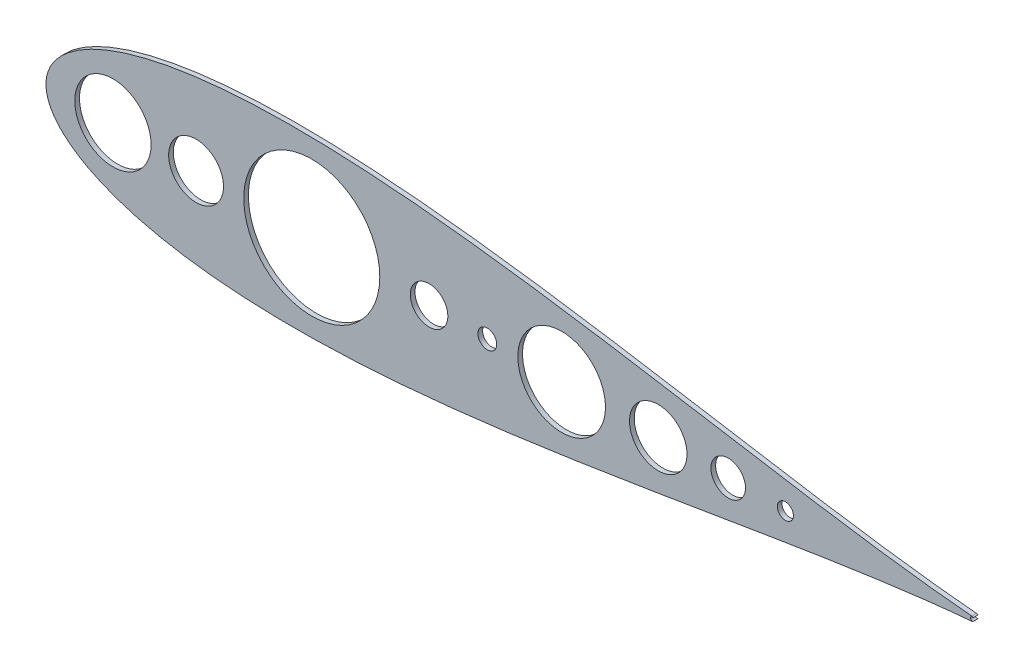
ISO-10303-21;
HEADER;
FILE_DESCRIPTION(('STEP AP214'),'2;1');
FILE_NAME('part.step','',(''),(''),'','','');
FILE_SCHEMA(('AUTOMOTIVE_DESIGN { 1 0 10303 214 1 1 1 1 }'));
ENDSEC;
DATA;
#1=APPLICATION_CONTEXT('core data for automotive mechanical design processes');
#2=APPLICATION_PROTOCOL_DEFINITION('international standard','automotive_design',2000,#1);
#3=PRODUCT_CONTEXT('',#1,'mechanical');
#4=PRODUCT('Part','Part','',(#3));
#5=PRODUCT_RELATED_PRODUCT_CATEGORY('part','',(#4));
#6=PRODUCT_DEFINITION_FORMATION('','',#4);
#7=PRODUCT_DEFINITION_CONTEXT('part definition',#1,'design');
#8=PRODUCT_DEFINITION('design','',#6,#7);
#9=PRODUCT_DEFINITION_SHAPE('','',#8);
#10=(LENGTH_UNIT() NAMED_UNIT(*) SI_UNIT(.MILLI.,.METRE.));
#11=(NAMED_UNIT(*) PLANE_ANGLE_UNIT() SI_UNIT($,.RADIAN.));
#12=(NAMED_UNIT(*) SI_UNIT($,.STERADIAN.) SOLID_ANGLE_UNIT());
#13=UNCERTAINTY_MEASURE_WITH_UNIT(LENGTH_MEASURE(1.E-05),#10,'distance_accuracy_value','');
#14=(GEOMETRIC_REPRESENTATION_CONTEXT(3) GLOBAL_UNCERTAINTY_ASSIGNED_CONTEXT((#13)) GLOBAL_UNIT_ASSIGNED_CONTEXT((#10,
#11,#12)) REPRESENTATION_CONTEXT('',''));
#15=CARTESIAN_POINT('',(0.,0.,0.));
#16=DIRECTION('',(0.,0.,1.));
#17=DIRECTION('',(1.,0.,0.));
#18=AXIS2_PLACEMENT_3D('',#15,#16,#17);
#19=CARTESIAN_POINT('',(750.96298118879,1063.57483485931,4.81012499999929));
#20=DIRECTION('',(0.,0.,1.));
#21=DIRECTION('',(1.,0.,0.));
#22=AXIS2_PLACEMENT_3D('',#19,#20,#21);
#23=PLANE('',#22);
#24=CARTESIAN_POINT('',(1225.90754513621,1063.57483486312,4.81012499999929));
#25=DIRECTION('',(0.,0.,1.));
#26=DIRECTION('',(1.,0.,0.));
#27=AXIS2_PLACEMENT_3D('',#24,#25,#26);
#28=CIRCLE('',#27,12.0363095643992);
#29=CARTESIAN_POINT('',(1237.94385470061,1063.57483486312,4.81012499999929));
#30=VERTEX_POINT('',#29);
#31=EDGE_CURVE('E163',#30,#30,#28,.T.);
#32=ORIENTED_EDGE('',*,*,#31,.F.);
#33=EDGE_LOOP('',(#32));
#34=FACE_BOUND('',#33,.T.);
#35=CARTESIAN_POINT('',(1265.69021931975,1063.57483486312,4.81012499999929));
#36=DIRECTION('',(0.,0.,1.));
#37=DIRECTION('',(1.,0.,0.));
#38=AXIS2_PLACEMENT_3D('',#35,#36,#37);
#39=CIRCLE('',#38,5.6061087540338);
#40=CARTESIAN_POINT('',(1271.29632807378,1063.57483486312,4.81012499999929));
#41=VERTEX_POINT('',#40);
#42=EDGE_CURVE('E151',#41,#41,#39,.T.);
#43=ORIENTED_EDGE('',*,*,#42,.F.);
#44=EDGE_LOOP('',(#43));
#45=FACE_BOUND('',#44,.T.);
#46=CARTESIAN_POINT('',(1109.95315939017,1063.57483486312,4.81012499999929));
#47=DIRECTION('',(0.,0.,1.));
#48=DIRECTION('',(1.,0.,0.));
#49=AXIS2_PLACEMENT_3D('',#46,#47,#48);
#50=CIRCLE('',#49,30.5054598019569);
#51=CARTESIAN_POINT('',(1140.45861919213,1063.57483486312,4.81012499999929));
#52=VERTEX_POINT('',#51);
#53=EDGE_CURVE('E139',#52,#52,#50,.T.);
#54=ORIENTED_EDGE('',*,*,#53,.F.);
#55=EDGE_LOOP('',(#54));
#56=FACE_BOUND('',#55,.T.);
#57=CARTESIAN_POINT('',(1017.6427119839,1063.57483486312,4.81012499999929));
#58=DIRECTION('',(0.,0.,1.));
#59=DIRECTION('',(1.,0.,0.));
#60=AXIS2_PLACEMENT_3D('',#57,#58,#59);
#61=CIRCLE('',#60,13.0809999999999);
#62=CARTESIAN_POINT('',(1030.7237119839,1063.57483486312,4.81012499999929));
#63=VERTEX_POINT('',#62);
#64=EDGE_CURVE('E127',#63,#63,#61,.T.);
#65=ORIENTED_EDGE('',*,*,#64,.F.);
#66=EDGE_LOOP('',(#65));
#67=FACE_BOUND('',#66,.T.);
#68=CARTESIAN_POINT('',(1395.54271540743,1065.1619681414,4.81012499999929));
#69=CARTESIAN_POINT('',(1395.02359226667,1065.2051382173,4.81012499999929));
#70=CARTESIAN_POINT('',(1391.11137142289,1065.53467168619,4.81012499999929));
#71=CARTESIAN_POINT('',(1383.40673114295,1066.24679645382,4.81012499999929));
#72=CARTESIAN_POINT('',(1371.97033086179,1067.43648312019,4.81012499999929));
#73=CARTESIAN_POINT('',(1359.29049716418,1068.89634410407,4.81012499999929));
#74=CARTESIAN_POINT('',(1345.41489513551,1070.63513095081,4.81012499999929));
#75=CARTESIAN_POINT('',(1330.40826044631,1072.65461405474,4.81012499999929));
#76=CARTESIAN_POINT('',(1314.33548887505,1074.95026580541,4.81012499999929));
#77=CARTESIAN_POINT('',(1297.2661813294,1077.51022817673,4.81012499999929));
#78=CARTESIAN_POINT('',(1279.27282238898,1080.3162900731,4.81012499999929));
#79=CARTESIAN_POINT('',(1260.43079370007,1083.34339698181,4.81012499999929));
#80=CARTESIAN_POINT('',(1240.81796180438,1086.56028304599,4.81012499999929));
#81=CARTESIAN_POINT('',(1220.51445178747,1089.92986172357,4.81012499999929));
#82=CARTESIAN_POINT('',(1199.60238766341,1093.40960189519,4.81012499999929));
#83=CARTESIAN_POINT('',(1178.1657547595,1096.95228942362,4.81012499999929));
#84=CARTESIAN_POINT('',(1156.29026158533,1100.50659397454,4.81012499999929));
#85=CARTESIAN_POINT('',(1134.06326757876,1104.01791043503,4.81012499999929));
#86=CARTESIAN_POINT('',(1111.57373575794,1107.42909486976,4.81012499999929));
#87=CARTESIAN_POINT('',(1088.912229171,1110.68147885688,4.81012499999929));
#88=CARTESIAN_POINT('',(1066.17090029136,1113.71561385179,4.81012499999929));
#89=CARTESIAN_POINT('',(1043.44351338479,1116.47233079811,4.81012499999929));
#90=CARTESIAN_POINT('',(1020.82546008262,1118.89359053819,4.81012499999929));
#91=CARTESIAN_POINT('',(998.41377395764,1120.92350871244,4.81012499999929));
#92=CARTESIAN_POINT('',(976.30712125808,1122.50917096927,4.81012499999929));
#93=CARTESIAN_POINT('',(954.605798988363,1123.60162243142,4.81012499999929));
#94=CARTESIAN_POINT('',(933.411713091856,1124.15678877121,4.81012499999929));
#95=CARTESIAN_POINT('',(912.828343784823,1124.13617779891,4.81012499999929));
#96=CARTESIAN_POINT('',(892.960780365688,1123.5070931482,4.81012499999929));
#97=CARTESIAN_POINT('',(873.915722858416,1122.24490422424,4.81012499999929));
#98=CARTESIAN_POINT('',(855.801792065221,1120.33130805021,4.81012499999929));
#99=CARTESIAN_POINT('',(838.729701584953,1117.75767882981,4.81012499999929));
#100=CARTESIAN_POINT('',(822.813292693368,1114.52311376375,4.81012499999929));
#101=CARTESIAN_POINT('',(808.170307258803,1110.63843631356,4.81012499999929));
#102=CARTESIAN_POINT('',(794.92453738176,1106.12641362733,4.81012499999929));
#103=CARTESIAN_POINT('',(783.208122525341,1101.02724858493,4.81012499999929));
#104=CARTESIAN_POINT('',(773.163344289858,1095.40846548432,4.81012499999929));
#105=CARTESIAN_POINT('',(764.94026711645,1089.38408601224,4.81012499999929));
#106=CARTESIAN_POINT('',(758.677358242983,1083.1508750198,4.81012499999929));
#107=CARTESIAN_POINT('',(754.437268830906,1077.0384028212,4.81012499999929));
#108=CARTESIAN_POINT('',(752.072876809349,1071.52373760801,4.81012499999929));
#109=CARTESIAN_POINT('',(751.118090619656,1067.09994589948,4.81012499999929));
#110=CARTESIAN_POINT('',(750.900629463039,1063.57483485931,4.81012499999929));
#111=CARTESIAN_POINT('',(751.118090619656,1060.04972381913,4.81012499999929));
#112=CARTESIAN_POINT('',(752.072876809349,1055.6259321106,4.81012499999929));
#113=CARTESIAN_POINT('',(754.437268830906,1050.11126689741,4.81012499999929));
#114=CARTESIAN_POINT('',(758.677358242983,1043.99879469882,4.81012499999929));
#115=CARTESIAN_POINT('',(764.94026711645,1037.76558370637,4.81012499999929));
#116=CARTESIAN_POINT('',(773.163344289858,1031.74120423429,4.81012499999929));
#117=CARTESIAN_POINT('',(783.208122525341,1026.12242113369,4.81012499999929));
#118=CARTESIAN_POINT('',(794.92453738176,1021.02325609128,4.81012499999929));
#119=CARTESIAN_POINT('',(808.170307258803,1016.51123340505,4.81012499999929));
#120=CARTESIAN_POINT('',(822.813292693368,1012.62655595486,4.81012499999929));
#121=CARTESIAN_POINT('',(838.729701584953,1009.3919908888,4.81012499999929));
#122=CARTESIAN_POINT('',(855.801792065221,1006.8183616684,4.81012499999929));
#123=CARTESIAN_POINT('',(873.915722858416,1004.90476549437,4.81012499999929));
#124=CARTESIAN_POINT('',(892.960780365688,1003.64257657042,4.81012499999929));
#125=CARTESIAN_POINT('',(912.828343784823,1003.01349191971,4.81012499999929));
#126=CARTESIAN_POINT('',(933.411713091856,1002.99288094741,4.81012499999929));
#127=CARTESIAN_POINT('',(954.605798988363,1003.54804728719,4.81012499999929));
#128=CARTESIAN_POINT('',(976.30712125808,1004.64049874934,4.81012499999929));
#129=CARTESIAN_POINT('',(998.41377395764,1006.22616100617,4.81012499999929));
#130=CARTESIAN_POINT('',(1020.82546008262,1008.25607918042,4.81012499999929));
#131=CARTESIAN_POINT('',(1043.44351338479,1010.67733892051,4.81012499999929));
#132=CARTESIAN_POINT('',(1066.17090029136,1013.43405586682,4.81012499999929));
#133=CARTESIAN_POINT('',(1088.912229171,1016.46819086173,4.81012499999929));
#134=CARTESIAN_POINT('',(1111.57373575794,1019.72057484885,4.81012499999929));
#135=CARTESIAN_POINT('',(1134.06326757876,1023.13175928358,4.81012499999929));
#136=CARTESIAN_POINT('',(1156.29026158533,1026.64307574407,4.81012499999929));
#137=CARTESIAN_POINT('',(1178.1657547595,1030.197380295,4.81012499999929));
#138=CARTESIAN_POINT('',(1199.60238766341,1033.74006782342,4.81012499999929));
#139=CARTESIAN_POINT('',(1220.51445178747,1037.21980799505,4.81012499999929));
#140=CARTESIAN_POINT('',(1240.81796180438,1040.58938667263,4.81012499999929));
#141=CARTESIAN_POINT('',(1260.43079370007,1043.80627273681,4.81012499999929));
#142=CARTESIAN_POINT('',(1279.27282238898,1046.83337964551,4.81012499999929));
#143=CARTESIAN_POINT('',(1297.2661813294,1049.63944154189,4.81012499999929));
#144=CARTESIAN_POINT('',(1314.33548887505,1052.1994039132,4.81012499999929));
#145=CARTESIAN_POINT('',(1330.40826044631,1054.49505566387,4.81012499999929));
#146=CARTESIAN_POINT('',(1345.41489513551,1056.51453876781,4.81012499999929));
#147=CARTESIAN_POINT('',(1359.29049716418,1058.25332561455,4.81012499999929));
#148=CARTESIAN_POINT('',(1371.97033086179,1059.71318659842,4.81012499999929));
#149=CARTESIAN_POINT('',(1383.40673114295,1060.9028732648,4.81012499999929));
#150=CARTESIAN_POINT('',(1391.1113714229,1061.61499803243,4.81012499999929));
#151=CARTESIAN_POINT('',(1395.02359226667,1061.94453150131,4.81012499999929));
#152=CARTESIAN_POINT('',(1395.54271540743,1061.98770158483,4.81012499999929));
#153=B_SPLINE_CURVE_WITH_KNOTS('',3,(#68,#69,#70,#71,#72,#73,#74,#75,#76,#77,#78,#79,#80,#81,
#82,#83,#84,#85,#86,#87,#88,#89,#90,#91,#92,#93,#94,#95,#96,#97,#98,#99,#100,#101,#102,#103,
#104,#105,#106,#107,#108,#109,#110,#111,#112,#113,#114,#115,#116,#117,#118,#119,#120,#121,#122,
#123,#124,#125,#126,#127,#128,#129,#130,#131,#132,#133,#134,#135,#136,#137,#138,#139,#140,#141,
#142,#143,#144,#145,#146,#147,#148,#149,#150,#151,#152),.UNSPECIFIED.,.F.,.F.,(4,1,1,1,1,1,1,1,
1,1,1,1,1,1,1,1,1,1,1,1,1,1,1,1,1,1,1,1,1,1,1,1,1,1,1,1,1,1,1,1,1,1,1,1,1,1,1,1,1,1,1,1,1,1,1,1,
1,1,1,1,1,1,1,1,1,1,1,1,1,1,1,1,1,1,1,1,1,1,1,1,1,1,4),(0.020157042076269,0.0212708876900959,
0.0285525550130683,0.0367806836725549,0.0459201019032637,0.0559317636633187,0.0667728836144854,
0.0783971303496518,0.0907548266908363,0.103793164577546,0.117456431914319,0.131686225652521,
0.146421738497113,0.161599998000845,0.177156132626574,0.193023668070302,0.209134785631037,
0.225420632511523,0.241811601924249,0.258237646860869,0.274628556698349,0.290914287398014,
0.307025228908797,0.322892517177238,0.33844834182358,0.353626206573582,0.368361231970712,
0.382590427827798,0.396252960572084,0.40929041186716,0.421647009590257,0.433269881487031,
0.444109248914041,0.454118639688981,0.463255054987312,0.471479113777303,0.478755288570903,
0.485052318112802,0.490344025694165,0.494609832614287,0.497833231437255,0.5,0.502166768562745,
0.505390167385713,0.509655974305835,0.514947681887198,0.521244711429097,0.528520886222697,
0.536744945012688,0.545881360311019,0.555890751085959,0.566730118512969,0.578352990409744,
0.59070958813284,0.603747039427916,0.617409572172202,0.631638768029288,0.646373793426418,
0.66155165817642,0.677107482822761,0.692974771091203,0.709085712601986,0.725371443301651,
0.741762353139131,0.758188398075751,0.774579367488477,0.790865214368963,0.806976331929698,
0.822843867373426,0.838400001999155,0.853578261502887,0.868313774347479,0.882543568085681,
0.896206835422454,0.909245173309164,0.921602869650348,0.933227116385514,0.944068236336681,
0.954079898096736,0.963219316327445,0.971447444986932,0.978729112309904,0.979842957923731),.UNSPECIFIED.);
#154=CARTESIAN_POINT('',(1395.54271540743,1065.1619681414,4.81012499999929));
#155=VERTEX_POINT('',#154);
#156=CARTESIAN_POINT('',(1395.54271540743,1061.98770158483,4.81012499999929));
#157=VERTEX_POINT('',#156);
#158=EDGE_CURVE('E87',#155,#157,#153,.T.);
#159=ORIENTED_EDGE('',*,*,#158,.T.);
#160=CARTESIAN_POINT('',(1395.4107300173,1063.57483486312,4.81012499999929));
#161=DIRECTION('',(0.,0.,1.));
#162=DIRECTION('',(1.,0.,0.));
#163=AXIS2_PLACEMENT_3D('',#160,#161,#162);
#164=CIRCLE('',#163,1.59261174999997);
#165=CARTESIAN_POINT('',(1396.53719164141,1062.44900343895,4.81012499999929));
#166=VERTEX_POINT('',#165);
#167=EDGE_CURVE('E82',#157,#166,#164,.T.);
#168=ORIENTED_EDGE('',*,*,#167,.T.);
#169=CARTESIAN_POINT('',(1395.91054943941,1063.57483486312,4.81012499999929));
#170=DIRECTION('',(0.,0.,-1.));
#171=DIRECTION('',(1.,0.,0.));
#172=AXIS2_PLACEMENT_3D('',#169,#170,#171);
#173=CIRCLE('',#172,1.28847849999987);
#174=CARTESIAN_POINT('',(1396.53719164141,1064.70066628728,4.81012499999929));
#175=VERTEX_POINT('',#174);
#176=EDGE_CURVE('E85',#166,#175,#173,.T.);
#177=ORIENTED_EDGE('',*,*,#176,.T.);
#178=CARTESIAN_POINT('',(1395.4107300173,1063.57483486312,4.81012499999929));
#179=DIRECTION('',(0.,0.,1.));
#180=DIRECTION('',(1.,0.,0.));
#181=AXIS2_PLACEMENT_3D('',#178,#179,#180);
#182=CIRCLE('',#181,1.59261174999997);
#183=EDGE_CURVE('E52',#175,#155,#182,.T.);
#184=ORIENTED_EDGE('',*,*,#183,.T.);
#185=EDGE_LOOP('',(#159,#168,#177,#184));
#186=FACE_BOUND('',#185,.T.);
#187=CARTESIAN_POINT('',(797.561846149155,1063.57483486312,4.81012499999929));
#188=DIRECTION('',(0.,0.,1.));
#189=DIRECTION('',(1.,0.,0.));
#190=AXIS2_PLACEMENT_3D('',#187,#188,#189);
#191=CIRCLE('',#190,26.5597967027053);
#192=CARTESIAN_POINT('',(824.12164285186,1063.57483486312,4.81012499999929));
#193=VERTEX_POINT('',#192);
#194=EDGE_CURVE('E103',#193,#193,#191,.T.);
#195=ORIENTED_EDGE('',*,*,#194,.F.);
#196=EDGE_LOOP('',(#195));
#197=FACE_BOUND('',#196,.T.);
#198=CARTESIAN_POINT('',(1177.19804743647,1063.57483486312,4.81012499999929));
#199=DIRECTION('',(0.,0.,1.));
#200=DIRECTION('',(1.,0.,0.));
#201=AXIS2_PLACEMENT_3D('',#198,#199,#200);
#202=CIRCLE('',#201,20.0025316274244);
#203=CARTESIAN_POINT('',(1197.2005790639,1063.57483486312,4.81012499999929));
#204=VERTEX_POINT('',#203);
#205=EDGE_CURVE('E133',#204,#204,#202,.T.);
#206=ORIENTED_EDGE('',*,*,#205,.F.);
#207=EDGE_LOOP('',(#206));
#208=FACE_BOUND('',#207,.T.);
#209=CARTESIAN_POINT('',(935.97297740518,1063.57483486312,4.81012499999929));
#210=DIRECTION('',(0.,0.,1.));
#211=DIRECTION('',(1.,0.,0.));
#212=AXIS2_PLACEMENT_3D('',#209,#210,#211);
#213=CIRCLE('',#212,47.3611230643591);
#214=CARTESIAN_POINT('',(983.334100469539,1063.57483486312,4.81012499999929));
#215=VERTEX_POINT('',#214);
#216=EDGE_CURVE('E145',#215,#215,#213,.T.);
#217=ORIENTED_EDGE('',*,*,#216,.F.);
#218=EDGE_LOOP('',(#217));
#219=FACE_BOUND('',#218,.T.);
#220=CARTESIAN_POINT('',(855.438311983901,1063.57483486312,4.81012499999929));
#221=DIRECTION('',(0.,0.,1.));
#222=DIRECTION('',(1.,0.,0.));
#223=AXIS2_PLACEMENT_3D('',#220,#221,#222);
#224=CIRCLE('',#223,19.0982600000001);
#225=CARTESIAN_POINT('',(874.536571983901,1063.57483486312,4.81012499999929));
#226=VERTEX_POINT('',#225);
#227=EDGE_CURVE('E157',#226,#226,#224,.T.);
#228=ORIENTED_EDGE('',*,*,#227,.F.);
#229=EDGE_LOOP('',(#228));
#230=FACE_BOUND('',#229,.T.);
#231=CARTESIAN_POINT('',(1058.1938119839,1063.57483486312,4.81012499999929));
#232=DIRECTION('',(0.,0.,1.));
#233=DIRECTION('',(1.,0.,0.));
#234=AXIS2_PLACEMENT_3D('',#231,#232,#233);
#235=CIRCLE('',#234,6.54050000000008);
#236=CARTESIAN_POINT('',(1064.7343119839,1063.57483486312,4.81012499999929));
#237=VERTEX_POINT('',#236);
#238=EDGE_CURVE('E169',#237,#237,#235,.T.);
#239=ORIENTED_EDGE('',*,*,#238,.F.);
#240=EDGE_LOOP('',(#239));
#241=FACE_BOUND('',#240,.T.);
#242=ADVANCED_FACE('F34',(#34,#45,#56,#67,#186,#197,#208,#219,#230,#241),#23,.T.);
#243=CARTESIAN_POINT('',(750.96298118879,1063.57483485931,1.53987499999929));
#244=DIRECTION('',(0.,0.,1.));
#245=DIRECTION('',(1.,0.,0.));
#246=AXIS2_PLACEMENT_3D('',#243,#244,#245);
#247=PLANE('',#246);
#248=CARTESIAN_POINT('',(1395.54271540743,1065.1619681414,1.53987499999929));
#249=CARTESIAN_POINT('',(1395.02359226667,1065.2051382173,1.53987499999929));
#250=CARTESIAN_POINT('',(1391.11137142289,1065.53467168619,1.53987499999929));
#251=CARTESIAN_POINT('',(1383.40673114295,1066.24679645382,1.53987499999929));
#252=CARTESIAN_POINT('',(1371.97033086179,1067.43648312019,1.53987499999929));
#253=CARTESIAN_POINT('',(1359.29049716418,1068.89634410407,1.53987499999929));
#254=CARTESIAN_POINT('',(1345.41489513551,1070.63513095081,1.53987499999929));
#255=CARTESIAN_POINT('',(1330.40826044631,1072.65461405474,1.53987499999929));
#256=CARTESIAN_POINT('',(1314.33548887505,1074.95026580541,1.53987499999929));
#257=CARTESIAN_POINT('',(1297.2661813294,1077.51022817673,1.53987499999929));
#258=CARTESIAN_POINT('',(1279.27282238898,1080.3162900731,1.53987499999929));
#259=CARTESIAN_POINT('',(1260.43079370007,1083.34339698181,1.53987499999929));
#260=CARTESIAN_POINT('',(1240.81796180438,1086.56028304599,1.53987499999929));
#261=CARTESIAN_POINT('',(1220.51445178747,1089.92986172357,1.53987499999929));
#262=CARTESIAN_POINT('',(1199.60238766341,1093.40960189519,1.53987499999929));
#263=CARTESIAN_POINT('',(1178.1657547595,1096.95228942362,1.53987499999929));
#264=CARTESIAN_POINT('',(1156.29026158533,1100.50659397454,1.53987499999929));
#265=CARTESIAN_POINT('',(1134.06326757876,1104.01791043503,1.53987499999929));
#266=CARTESIAN_POINT('',(1111.57373575794,1107.42909486976,1.53987499999929));
#267=CARTESIAN_POINT('',(1088.912229171,1110.68147885688,1.53987499999929));
#268=CARTESIAN_POINT('',(1066.17090029136,1113.71561385179,1.53987499999929));
#269=CARTESIAN_POINT('',(1043.44351338479,1116.47233079811,1.53987499999929));
#270=CARTESIAN_POINT('',(1020.82546008262,1118.89359053819,1.53987499999929));
#271=CARTESIAN_POINT('',(998.41377395764,1120.92350871244,1.53987499999929));
#272=CARTESIAN_POINT('',(976.30712125808,1122.50917096927,1.53987499999929));
#273=CARTESIAN_POINT('',(954.605798988363,1123.60162243142,1.53987499999929));
#274=CARTESIAN_POINT('',(933.411713091856,1124.15678877121,1.53987499999929));
#275=CARTESIAN_POINT('',(912.828343784823,1124.13617779891,1.53987499999929));
#276=CARTESIAN_POINT('',(892.960780365688,1123.5070931482,1.53987499999929));
#277=CARTESIAN_POINT('',(873.915722858416,1122.24490422424,1.53987499999929));
#278=CARTESIAN_POINT('',(855.801792065221,1120.33130805021,1.53987499999929));
#279=CARTESIAN_POINT('',(838.729701584953,1117.75767882981,1.53987499999929));
#280=CARTESIAN_POINT('',(822.813292693368,1114.52311376375,1.53987499999929));
#281=CARTESIAN_POINT('',(808.170307258803,1110.63843631356,1.53987499999929));
#282=CARTESIAN_POINT('',(794.92453738176,1106.12641362733,1.53987499999929));
#283=CARTESIAN_POINT('',(783.208122525341,1101.02724858493,1.53987499999929));
#284=CARTESIAN_POINT('',(773.163344289858,1095.40846548432,1.53987499999929));
#285=CARTESIAN_POINT('',(764.94026711645,1089.38408601224,1.53987499999929));
#286=CARTESIAN_POINT('',(758.677358242983,1083.1508750198,1.53987499999929));
#287=CARTESIAN_POINT('',(754.437268830906,1077.0384028212,1.53987499999929));
#288=CARTESIAN_POINT('',(752.072876809349,1071.52373760801,1.53987499999929));
#289=CARTESIAN_POINT('',(751.118090619656,1067.09994589948,1.53987499999929));
#290=CARTESIAN_POINT('',(750.900629463039,1063.57483485931,1.53987499999929));
#291=CARTESIAN_POINT('',(751.118090619656,1060.04972381913,1.53987499999929));
#292=CARTESIAN_POINT('',(752.072876809349,1055.6259321106,1.53987499999929));
#293=CARTESIAN_POINT('',(754.437268830906,1050.11126689741,1.53987499999929));
#294=CARTESIAN_POINT('',(758.677358242983,1043.99879469882,1.53987499999929));
#295=CARTESIAN_POINT('',(764.94026711645,1037.76558370637,1.53987499999929));
#296=CARTESIAN_POINT('',(773.163344289858,1031.74120423429,1.53987499999929));
#297=CARTESIAN_POINT('',(783.208122525341,1026.12242113369,1.53987499999929));
#298=CARTESIAN_POINT('',(794.92453738176,1021.02325609128,1.53987499999929));
#299=CARTESIAN_POINT('',(808.170307258803,1016.51123340505,1.53987499999929));
#300=CARTESIAN_POINT('',(822.813292693368,1012.62655595486,1.53987499999929));
#301=CARTESIAN_POINT('',(838.729701584953,1009.3919908888,1.53987499999929));
#302=CARTESIAN_POINT('',(855.801792065221,1006.8183616684,1.53987499999929));
#303=CARTESIAN_POINT('',(873.915722858416,1004.90476549437,1.53987499999929));
#304=CARTESIAN_POINT('',(892.960780365688,1003.64257657042,1.53987499999929));
#305=CARTESIAN_POINT('',(912.828343784823,1003.01349191971,1.53987499999929));
#306=CARTESIAN_POINT('',(933.411713091856,1002.99288094741,1.53987499999929));
#307=CARTESIAN_POINT('',(954.605798988363,1003.54804728719,1.53987499999929));
#308=CARTESIAN_POINT('',(976.30712125808,1004.64049874934,1.53987499999929));
#309=CARTESIAN_POINT('',(998.41377395764,1006.22616100617,1.53987499999929));
#310=CARTESIAN_POINT('',(1020.82546008262,1008.25607918042,1.53987499999929));
#311=CARTESIAN_POINT('',(1043.44351338479,1010.67733892051,1.53987499999929));
#312=CARTESIAN_POINT('',(1066.17090029136,1013.43405586682,1.53987499999929));
#313=CARTESIAN_POINT('',(1088.912229171,1016.46819086173,1.53987499999929));
#314=CARTESIAN_POINT('',(1111.57373575794,1019.72057484885,1.53987499999929));
#315=CARTESIAN_POINT('',(1134.06326757876,1023.13175928358,1.53987499999929));
#316=CARTESIAN_POINT('',(1156.29026158533,1026.64307574407,1.53987499999929));
#317=CARTESIAN_POINT('',(1178.1657547595,1030.197380295,1.53987499999929));
#318=CARTESIAN_POINT('',(1199.60238766341,1033.74006782342,1.53987499999929));
#319=CARTESIAN_POINT('',(1220.51445178747,1037.21980799505,1.53987499999929));
#320=CARTESIAN_POINT('',(1240.81796180438,1040.58938667263,1.53987499999929));
#321=CARTESIAN_POINT('',(1260.43079370007,1043.80627273681,1.53987499999929));
#322=CARTESIAN_POINT('',(1279.27282238898,1046.83337964551,1.53987499999929));
#323=CARTESIAN_POINT('',(1297.2661813294,1049.63944154189,1.53987499999929));
#324=CARTESIAN_POINT('',(1314.33548887505,1052.1994039132,1.53987499999929));
#325=CARTESIAN_POINT('',(1330.40826044631,1054.49505566387,1.53987499999929));
#326=CARTESIAN_POINT('',(1345.41489513551,1056.51453876781,1.53987499999929));
#327=CARTESIAN_POINT('',(1359.29049716418,1058.25332561455,1.53987499999929));
#328=CARTESIAN_POINT('',(1371.97033086179,1059.71318659842,1.53987499999929));
#329=CARTESIAN_POINT('',(1383.40673114295,1060.9028732648,1.53987499999929));
#330=CARTESIAN_POINT('',(1391.1113714229,1061.61499803243,1.53987499999929));
#331=CARTESIAN_POINT('',(1395.02359226667,1061.94453150131,1.53987499999929));
#332=CARTESIAN_POINT('',(1395.54271540743,1061.98770158483,1.53987499999929));
#333=B_SPLINE_CURVE_WITH_KNOTS('',3,(#248,#249,#250,#251,#252,#253,#254,#255,#256,#257,#258,
#259,#260,#261,#262,#263,#264,#265,#266,#267,#268,#269,#270,#271,#272,#273,#274,#275,#276,#277,
#278,#279,#280,#281,#282,#283,#284,#285,#286,#287,#288,#289,#290,#291,#292,#293,#294,#295,#296,
#297,#298,#299,#300,#301,#302,#303,#304,#305,#306,#307,#308,#309,#310,#311,#312,#313,#314,#315,
#316,#317,#318,#319,#320,#321,#322,#323,#324,#325,#326,#327,#328,#329,#330,#331,#332),
.UNSPECIFIED.,.F.,.F.,(4,1,1,1,1,1,1,1,1,1,1,1,1,1,1,1,1,1,1,1,1,1,1,1,1,1,1,1,1,1,1,1,1,1,1,1,
1,1,1,1,1,1,1,1,1,1,1,1,1,1,1,1,1,1,1,1,1,1,1,1,1,1,1,1,1,1,1,1,1,1,1,1,1,1,1,1,1,1,1,1,1,1,4),
(0.020157042076269,0.0212708876900959,0.0285525550130683,0.0367806836725549,0.0459201019032637,
0.0559317636633187,0.0667728836144854,0.0783971303496518,0.0907548266908363,0.103793164577546,
0.117456431914319,0.131686225652521,0.146421738497113,0.161599998000845,0.177156132626574,
0.193023668070302,0.209134785631037,0.225420632511523,0.241811601924249,0.258237646860869,
0.274628556698349,0.290914287398014,0.307025228908797,0.322892517177238,0.33844834182358,
0.353626206573582,0.368361231970712,0.382590427827798,0.396252960572084,0.40929041186716,
0.421647009590257,0.433269881487031,0.444109248914041,0.454118639688981,0.463255054987312,
0.471479113777303,0.478755288570903,0.485052318112802,0.490344025694165,0.494609832614287,
0.497833231437255,0.5,0.502166768562745,0.505390167385713,0.509655974305835,0.514947681887198,
0.521244711429097,0.528520886222697,0.536744945012688,0.545881360311019,0.555890751085959,
0.566730118512969,0.578352990409744,0.59070958813284,0.603747039427916,0.617409572172202,
0.631638768029288,0.646373793426418,0.66155165817642,0.677107482822761,0.692974771091203,
0.709085712601986,0.725371443301651,0.741762353139131,0.758188398075751,0.774579367488477,
0.790865214368963,0.806976331929698,0.822843867373426,0.838400001999155,0.853578261502887,
0.868313774347479,0.882543568085681,0.896206835422454,0.909245173309164,0.921602869650348,
0.933227116385514,0.944068236336681,0.954079898096736,0.963219316327445,0.971447444986932,
0.978729112309904,0.979842957923731),.UNSPECIFIED.);
#334=CARTESIAN_POINT('',(1395.54271540743,1065.1619681414,1.53987499999929));
#335=VERTEX_POINT('',#334);
#336=CARTESIAN_POINT('',(1395.54271540743,1061.98770158483,1.53987499999929));
#337=VERTEX_POINT('',#336);
#338=EDGE_CURVE('E98',#335,#337,#333,.T.);
#339=ORIENTED_EDGE('',*,*,#338,.F.);
#340=CARTESIAN_POINT('',(1395.4107300173,1063.57483486312,1.53987499999929));
#341=DIRECTION('',(0.,0.,1.));
#342=DIRECTION('',(1.,0.,0.));
#343=AXIS2_PLACEMENT_3D('',#340,#341,#342);
#344=CIRCLE('',#343,1.59261174999997);
#345=CARTESIAN_POINT('',(1396.53719164141,1064.70066628728,1.53987499999929));
#346=VERTEX_POINT('',#345);
#347=EDGE_CURVE('E75',#346,#335,#344,.T.);
#348=ORIENTED_EDGE('',*,*,#347,.F.);
#349=CARTESIAN_POINT('',(1395.91054943941,1063.57483486312,1.53987499999929));
#350=DIRECTION('',(0.,0.,-1.));
#351=DIRECTION('',(1.,0.,0.));
#352=AXIS2_PLACEMENT_3D('',#349,#350,#351);
#353=CIRCLE('',#352,1.28847849999987);
#354=CARTESIAN_POINT('',(1396.53719164141,1062.44900343895,1.53987499999929));
#355=VERTEX_POINT('',#354);
#356=EDGE_CURVE('E69',#355,#346,#353,.T.);
#357=ORIENTED_EDGE('',*,*,#356,.F.);
#358=CARTESIAN_POINT('',(1395.4107300173,1063.57483486312,1.53987499999929));
#359=DIRECTION('',(0.,0.,1.));
#360=DIRECTION('',(1.,0.,0.));
#361=AXIS2_PLACEMENT_3D('',#358,#359,#360);
#362=CIRCLE('',#361,1.59261174999997);
#363=EDGE_CURVE('E91',#337,#355,#362,.T.);
#364=ORIENTED_EDGE('',*,*,#363,.F.);
#365=EDGE_LOOP('',(#339,#348,#357,#364));
#366=FACE_BOUND('',#365,.T.);
#367=CARTESIAN_POINT('',(797.561846149155,1063.57483486312,1.53987499999929));
#368=DIRECTION('',(0.,0.,1.));
#369=DIRECTION('',(1.,0.,0.));
#370=AXIS2_PLACEMENT_3D('',#367,#368,#369);
#371=CIRCLE('',#370,26.5597967027053);
#372=CARTESIAN_POINT('',(824.12164285186,1063.57483486312,1.53987499999929));
#373=VERTEX_POINT('',#372);
#374=EDGE_CURVE('E121',#373,#373,#371,.T.);
#375=ORIENTED_EDGE('',*,*,#374,.T.);
#376=EDGE_LOOP('',(#375));
#377=FACE_BOUND('',#376,.T.);
#378=CARTESIAN_POINT('',(1017.6427119839,1063.57483486312,1.53987499999929));
#379=DIRECTION('',(0.,0.,1.));
#380=DIRECTION('',(1.,0.,0.));
#381=AXIS2_PLACEMENT_3D('',#378,#379,#380);
#382=CIRCLE('',#381,13.0809999999999);
#383=CARTESIAN_POINT('',(1030.7237119839,1063.57483486312,1.53987499999929));
#384=VERTEX_POINT('',#383);
#385=EDGE_CURVE('E130',#384,#384,#382,.T.);
#386=ORIENTED_EDGE('',*,*,#385,.T.);
#387=EDGE_LOOP('',(#386));
#388=FACE_BOUND('',#387,.T.);
#389=CARTESIAN_POINT('',(1177.19804743647,1063.57483486312,1.53987499999929));
#390=DIRECTION('',(0.,0.,1.));
#391=DIRECTION('',(1.,0.,0.));
#392=AXIS2_PLACEMENT_3D('',#389,#390,#391);
#393=CIRCLE('',#392,20.0025316274244);
#394=CARTESIAN_POINT('',(1197.2005790639,1063.57483486312,1.53987499999929));
#395=VERTEX_POINT('',#394);
#396=EDGE_CURVE('E136',#395,#395,#393,.T.);
#397=ORIENTED_EDGE('',*,*,#396,.T.);
#398=EDGE_LOOP('',(#397));
#399=FACE_BOUND('',#398,.T.);
#400=CARTESIAN_POINT('',(1109.95315939017,1063.57483486312,1.53987499999929));
#401=DIRECTION('',(0.,0.,1.));
#402=DIRECTION('',(1.,0.,0.));
#403=AXIS2_PLACEMENT_3D('',#400,#401,#402);
#404=CIRCLE('',#403,30.5054598019569);
#405=CARTESIAN_POINT('',(1140.45861919213,1063.57483486312,1.53987499999929));
#406=VERTEX_POINT('',#405);
#407=EDGE_CURVE('E142',#406,#406,#404,.T.);
#408=ORIENTED_EDGE('',*,*,#407,.T.);
#409=EDGE_LOOP('',(#408));
#410=FACE_BOUND('',#409,.T.);
#411=CARTESIAN_POINT('',(935.97297740518,1063.57483486312,1.53987499999929));
#412=DIRECTION('',(0.,0.,1.));
#413=DIRECTION('',(1.,0.,0.));
#414=AXIS2_PLACEMENT_3D('',#411,#412,#413);
#415=CIRCLE('',#414,47.3611230643591);
#416=CARTESIAN_POINT('',(983.334100469539,1063.57483486312,1.53987499999929));
#417=VERTEX_POINT('',#416);
#418=EDGE_CURVE('E148',#417,#417,#415,.T.);
#419=ORIENTED_EDGE('',*,*,#418,.T.);
#420=EDGE_LOOP('',(#419));
#421=FACE_BOUND('',#420,.T.);
#422=CARTESIAN_POINT('',(1265.69021931975,1063.57483486312,1.53987499999929));
#423=DIRECTION('',(0.,0.,1.));
#424=DIRECTION('',(1.,0.,0.));
#425=AXIS2_PLACEMENT_3D('',#422,#423,#424);
#426=CIRCLE('',#425,5.6061087540338);
#427=CARTESIAN_POINT('',(1271.29632807378,1063.57483486312,1.53987499999929));
#428=VERTEX_POINT('',#427);
#429=EDGE_CURVE('E154',#428,#428,#426,.T.);
#430=ORIENTED_EDGE('',*,*,#429,.T.);
#431=EDGE_LOOP('',(#430));
#432=FACE_BOUND('',#431,.T.);
#433=CARTESIAN_POINT('',(855.438311983901,1063.57483486312,1.53987499999929));
#434=DIRECTION('',(0.,0.,1.));
#435=DIRECTION('',(1.,0.,0.));
#436=AXIS2_PLACEMENT_3D('',#433,#434,#435);
#437=CIRCLE('',#436,19.0982600000001);
#438=CARTESIAN_POINT('',(874.536571983901,1063.57483486312,1.53987499999929));
#439=VERTEX_POINT('',#438);
#440=EDGE_CURVE('E160',#439,#439,#437,.T.);
#441=ORIENTED_EDGE('',*,*,#440,.T.);
#442=EDGE_LOOP('',(#441));
#443=FACE_BOUND('',#442,.T.);
#444=CARTESIAN_POINT('',(1225.90754513621,1063.57483486312,1.53987499999929));
#445=DIRECTION('',(0.,0.,1.));
#446=DIRECTION('',(1.,0.,0.));
#447=AXIS2_PLACEMENT_3D('',#444,#445,#446);
#448=CIRCLE('',#447,12.0363095643992);
#449=CARTESIAN_POINT('',(1237.94385470061,1063.57483486312,1.53987499999929));
#450=VERTEX_POINT('',#449);
#451=EDGE_CURVE('E166',#450,#450,#448,.T.);
#452=ORIENTED_EDGE('',*,*,#451,.T.);
#453=EDGE_LOOP('',(#452));
#454=FACE_BOUND('',#453,.T.);
#455=CARTESIAN_POINT('',(1058.1938119839,1063.57483486312,1.53987499999929));
#456=DIRECTION('',(0.,0.,1.));
#457=DIRECTION('',(1.,0.,0.));
#458=AXIS2_PLACEMENT_3D('',#455,#456,#457);
#459=CIRCLE('',#458,6.54050000000008);
#460=CARTESIAN_POINT('',(1064.7343119839,1063.57483486312,1.53987499999929));
#461=VERTEX_POINT('',#460);
#462=EDGE_CURVE('E172',#461,#461,#459,.T.);
#463=ORIENTED_EDGE('',*,*,#462,.T.);
#464=EDGE_LOOP('',(#463));
#465=FACE_BOUND('',#464,.T.);
#466=ADVANCED_FACE('F114',(#366,#377,#388,#399,#410,#421,#432,#443,#454,#465),#247,.F.);
#467=DIRECTION('',(0.,0.,-1.));
#468=VECTOR('',#467,1.);
#469=SURFACE_OF_LINEAR_EXTRUSION('',#153,#468);
#470=ORIENTED_EDGE('',*,*,#338,.T.);
#471=DIRECTION('',(0.,0.,-1.));
#472=VECTOR('',#471,1.);
#473=CARTESIAN_POINT('',(1395.54271540743,1061.98770158483,4.81012499999929));
#474=LINE('',#473,#472);
#475=EDGE_CURVE('E11',#157,#337,#474,.T.);
#476=ORIENTED_EDGE('',*,*,#475,.F.);
#477=ORIENTED_EDGE('',*,*,#158,.F.);
#478=DIRECTION('',(0.,0.,-1.));
#479=VECTOR('',#478,1.);
#480=CARTESIAN_POINT('',(1395.54271540743,1065.1619681414,4.81012499999929));
#481=LINE('',#480,#479);
#482=EDGE_CURVE('E95',#155,#335,#481,.T.);
#483=ORIENTED_EDGE('',*,*,#482,.T.);
#484=EDGE_LOOP('',(#470,#476,#477,#483));
#485=FACE_BOUND('',#484,.T.);
#486=ADVANCED_FACE('F36',(#485),#469,.F.);
#487=CARTESIAN_POINT('',(1395.4107300173,1063.57483486312,4.81012499999929));
#488=DIRECTION('',(0.,0.,-1.));
#489=DIRECTION('',(-1.,0.,0.));
#490=AXIS2_PLACEMENT_3D('',#487,#488,#489);
#491=CYLINDRICAL_SURFACE('',#490,1.59261174999997);
#492=ORIENTED_EDGE('',*,*,#363,.T.);
#493=DIRECTION('',(0.,0.,-1.));
#494=VECTOR('',#493,1.);
#495=CARTESIAN_POINT('',(1396.53719164141,1062.44900343895,4.81012499999929));
#496=LINE('',#495,#494);
#497=EDGE_CURVE('E44',#166,#355,#496,.T.);
#498=ORIENTED_EDGE('',*,*,#497,.F.);
#499=ORIENTED_EDGE('',*,*,#167,.F.);
#500=ORIENTED_EDGE('',*,*,#475,.T.);
#501=EDGE_LOOP('',(#492,#498,#499,#500));
#502=FACE_BOUND('',#501,.T.);
#503=ADVANCED_FACE('F90',(#502),#491,.T.);
#504=CARTESIAN_POINT('',(1395.91054943941,1063.57483486312,4.81012499999929));
#505=DIRECTION('',(0.,0.,-1.));
#506=DIRECTION('',(-1.,0.,0.));
#507=AXIS2_PLACEMENT_3D('',#504,#505,#506);
#508=CYLINDRICAL_SURFACE('',#507,1.28847849999987);
#509=ORIENTED_EDGE('',*,*,#356,.T.);
#510=DIRECTION('',(0.,0.,-1.));
#511=VECTOR('',#510,1.);
#512=CARTESIAN_POINT('',(1396.53719164141,1064.70066628728,4.81012499999929));
#513=LINE('',#512,#511);
#514=EDGE_CURVE('E92',#175,#346,#513,.T.);
#515=ORIENTED_EDGE('',*,*,#514,.F.);
#516=ORIENTED_EDGE('',*,*,#176,.F.);
#517=ORIENTED_EDGE('',*,*,#497,.T.);
#518=EDGE_LOOP('',(#509,#515,#516,#517));
#519=FACE_BOUND('',#518,.T.);
#520=ADVANCED_FACE('F93',(#519),#508,.F.);
#521=CARTESIAN_POINT('',(1395.4107300173,1063.57483486312,4.81012499999929));
#522=DIRECTION('',(0.,0.,-1.));
#523=DIRECTION('',(-1.,0.,0.));
#524=AXIS2_PLACEMENT_3D('',#521,#522,#523);
#525=CYLINDRICAL_SURFACE('',#524,1.59261174999997);
#526=ORIENTED_EDGE('',*,*,#347,.T.);
#527=ORIENTED_EDGE('',*,*,#482,.F.);
#528=ORIENTED_EDGE('',*,*,#183,.F.);
#529=ORIENTED_EDGE('',*,*,#514,.T.);
#530=EDGE_LOOP('',(#526,#527,#528,#529));
#531=FACE_BOUND('',#530,.T.);
#532=ADVANCED_FACE('F111',(#531),#525,.T.);
#533=CARTESIAN_POINT('',(797.561846149155,1063.57483486312,4.81012499999929));
#534=DIRECTION('',(0.,0.,-1.));
#535=DIRECTION('',(-1.,0.,0.));
#536=AXIS2_PLACEMENT_3D('',#533,#534,#535);
#537=CYLINDRICAL_SURFACE('',#536,26.5597967027053);
#538=ORIENTED_EDGE('',*,*,#194,.T.);
#539=EDGE_LOOP('',(#538));
#540=FACE_BOUND('',#539,.T.);
#541=ORIENTED_EDGE('',*,*,#374,.F.);
#542=EDGE_LOOP('',(#541));
#543=FACE_BOUND('',#542,.T.);
#544=ADVANCED_FACE('F191',(#540,#543),#537,.F.);
#545=CARTESIAN_POINT('',(1017.6427119839,1063.57483486312,4.81012499999929));
#546=DIRECTION('',(0.,0.,-1.));
#547=DIRECTION('',(-1.,0.,0.));
#548=AXIS2_PLACEMENT_3D('',#545,#546,#547);
#549=CYLINDRICAL_SURFACE('',#548,13.0809999999999);
#550=ORIENTED_EDGE('',*,*,#64,.T.);
#551=EDGE_LOOP('',(#550));
#552=FACE_BOUND('',#551,.T.);
#553=ORIENTED_EDGE('',*,*,#385,.F.);
#554=EDGE_LOOP('',(#553));
#555=FACE_BOUND('',#554,.T.);
#556=ADVANCED_FACE('F237',(#552,#555),#549,.F.);
#557=CARTESIAN_POINT('',(1177.19804743647,1063.57483486312,4.81012499999929));
#558=DIRECTION('',(0.,0.,-1.));
#559=DIRECTION('',(-1.,0.,0.));
#560=AXIS2_PLACEMENT_3D('',#557,#558,#559);
#561=CYLINDRICAL_SURFACE('',#560,20.0025316274244);
#562=ORIENTED_EDGE('',*,*,#205,.T.);
#563=EDGE_LOOP('',(#562));
#564=FACE_BOUND('',#563,.T.);
#565=ORIENTED_EDGE('',*,*,#396,.F.);
#566=EDGE_LOOP('',(#565));
#567=FACE_BOUND('',#566,.T.);
#568=ADVANCED_FACE('F245',(#564,#567),#561,.F.);
#569=CARTESIAN_POINT('',(1109.95315939017,1063.57483486312,4.81012499999929));
#570=DIRECTION('',(0.,0.,-1.));
#571=DIRECTION('',(-1.,0.,0.));
#572=AXIS2_PLACEMENT_3D('',#569,#570,#571);
#573=CYLINDRICAL_SURFACE('',#572,30.5054598019569);
#574=ORIENTED_EDGE('',*,*,#53,.T.);
#575=EDGE_LOOP('',(#574));
#576=FACE_BOUND('',#575,.T.);
#577=ORIENTED_EDGE('',*,*,#407,.F.);
#578=EDGE_LOOP('',(#577));
#579=FACE_BOUND('',#578,.T.);
#580=ADVANCED_FACE('F253',(#576,#579),#573,.F.);
#581=CARTESIAN_POINT('',(935.97297740518,1063.57483486312,4.81012499999929));
#582=DIRECTION('',(0.,0.,-1.));
#583=DIRECTION('',(-1.,0.,0.));
#584=AXIS2_PLACEMENT_3D('',#581,#582,#583);
#585=CYLINDRICAL_SURFACE('',#584,47.3611230643591);
#586=ORIENTED_EDGE('',*,*,#216,.T.);
#587=EDGE_LOOP('',(#586));
#588=FACE_BOUND('',#587,.T.);
#589=ORIENTED_EDGE('',*,*,#418,.F.);
#590=EDGE_LOOP('',(#589));
#591=FACE_BOUND('',#590,.T.);
#592=ADVANCED_FACE('F262',(#588,#591),#585,.F.);
#593=CARTESIAN_POINT('',(1265.69021931975,1063.57483486312,4.81012499999929));
#594=DIRECTION('',(0.,0.,-1.));
#595=DIRECTION('',(-1.,0.,0.));
#596=AXIS2_PLACEMENT_3D('',#593,#594,#595);
#597=CYLINDRICAL_SURFACE('',#596,5.6061087540338);
#598=ORIENTED_EDGE('',*,*,#42,.T.);
#599=EDGE_LOOP('',(#598));
#600=FACE_BOUND('',#599,.T.);
#601=ORIENTED_EDGE('',*,*,#429,.F.);
#602=EDGE_LOOP('',(#601));
#603=FACE_BOUND('',#602,.T.);
#604=ADVANCED_FACE('F271',(#600,#603),#597,.F.);
#605=CARTESIAN_POINT('',(855.438311983901,1063.57483486312,4.81012499999929));
#606=DIRECTION('',(0.,0.,-1.));
#607=DIRECTION('',(-1.,0.,0.));
#608=AXIS2_PLACEMENT_3D('',#605,#606,#607);
#609=CYLINDRICAL_SURFACE('',#608,19.0982600000001);
#610=ORIENTED_EDGE('',*,*,#227,.T.);
#611=EDGE_LOOP('',(#610));
#612=FACE_BOUND('',#611,.T.);
#613=ORIENTED_EDGE('',*,*,#440,.F.);
#614=EDGE_LOOP('',(#613));
#615=FACE_BOUND('',#614,.T.);
#616=ADVANCED_FACE('F280',(#612,#615),#609,.F.);
#617=CARTESIAN_POINT('',(1225.90754513621,1063.57483486312,4.81012499999929));
#618=DIRECTION('',(0.,0.,-1.));
#619=DIRECTION('',(-1.,0.,0.));
#620=AXIS2_PLACEMENT_3D('',#617,#618,#619);
#621=CYLINDRICAL_SURFACE('',#620,12.0363095643992);
#622=ORIENTED_EDGE('',*,*,#31,.T.);
#623=EDGE_LOOP('',(#622));
#624=FACE_BOUND('',#623,.T.);
#625=ORIENTED_EDGE('',*,*,#451,.F.);
#626=EDGE_LOOP('',(#625));
#627=FACE_BOUND('',#626,.T.);
#628=ADVANCED_FACE('F289',(#624,#627),#621,.F.);
#629=CARTESIAN_POINT('',(1058.1938119839,1063.57483486312,4.81012499999929));
#630=DIRECTION('',(0.,0.,-1.));
#631=DIRECTION('',(-1.,0.,0.));
#632=AXIS2_PLACEMENT_3D('',#629,#630,#631);
#633=CYLINDRICAL_SURFACE('',#632,6.54050000000008);
#634=ORIENTED_EDGE('',*,*,#238,.T.);
#635=EDGE_LOOP('',(#634));
#636=FACE_BOUND('',#635,.T.);
#637=ORIENTED_EDGE('',*,*,#462,.F.);
#638=EDGE_LOOP('',(#637));
#639=FACE_BOUND('',#638,.T.);
#640=ADVANCED_FACE('F178',(#636,#639),#633,.F.);
#641=CLOSED_SHELL('',(#242,#466,#486,#503,#520,#532,#544,#556,#568,#580,#592,#604,#616,#628,#640));
#642=MANIFOLD_SOLID_BREP('B2',#641);
#643=ADVANCED_BREP_SHAPE_REPRESENTATION('',(#18,#642),#14);
#644=SHAPE_DEFINITION_REPRESENTATION(#9,#643);
ENDSEC;
END-ISO-10303-21;
